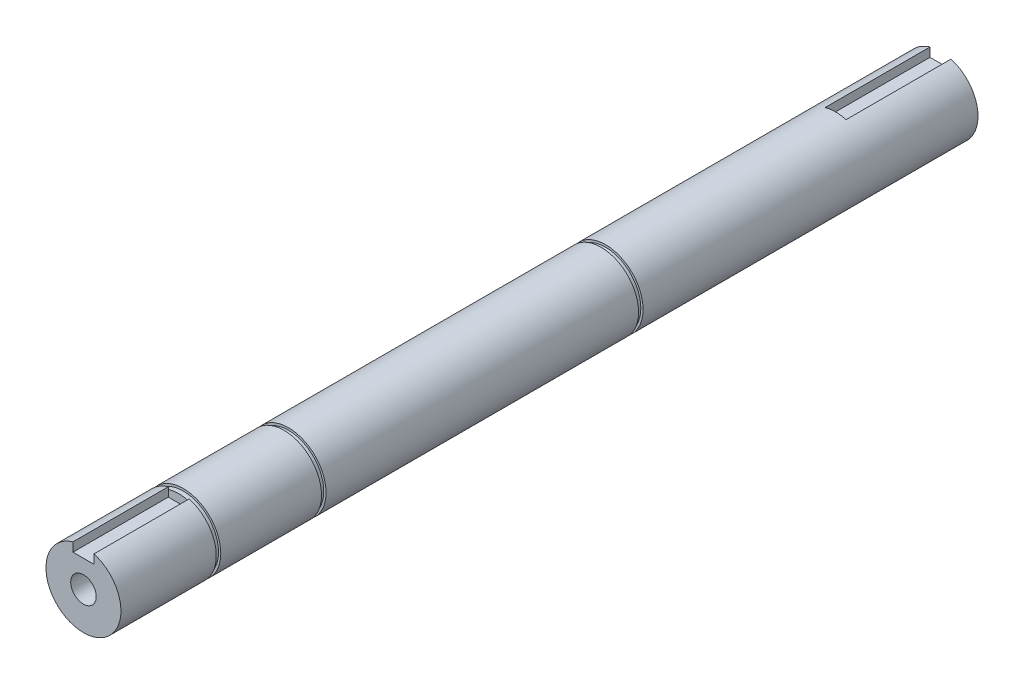
ISO-10303-21;
HEADER;
FILE_DESCRIPTION(('STEP AP214'),'2;1');
FILE_NAME('part.step','',(''),(''),'','','');
FILE_SCHEMA(('AUTOMOTIVE_DESIGN { 1 0 10303 214 1 1 1 1 }'));
ENDSEC;
DATA;
#1=APPLICATION_CONTEXT('core data for automotive mechanical design processes');
#2=APPLICATION_PROTOCOL_DEFINITION('international standard','automotive_design',2000,#1);
#3=PRODUCT_CONTEXT('',#1,'mechanical');
#4=PRODUCT('Part','Part','',(#3));
#5=PRODUCT_RELATED_PRODUCT_CATEGORY('part','',(#4));
#6=PRODUCT_DEFINITION_FORMATION('','',#4);
#7=PRODUCT_DEFINITION_CONTEXT('part definition',#1,'design');
#8=PRODUCT_DEFINITION('design','',#6,#7);
#9=PRODUCT_DEFINITION_SHAPE('','',#8);
#10=(LENGTH_UNIT() NAMED_UNIT(*) SI_UNIT(.MILLI.,.METRE.));
#11=(NAMED_UNIT(*) PLANE_ANGLE_UNIT() SI_UNIT($,.RADIAN.));
#12=(NAMED_UNIT(*) SI_UNIT($,.STERADIAN.) SOLID_ANGLE_UNIT());
#13=UNCERTAINTY_MEASURE_WITH_UNIT(LENGTH_MEASURE(1.E-05),#10,'distance_accuracy_value','');
#14=(GEOMETRIC_REPRESENTATION_CONTEXT(3) GLOBAL_UNCERTAINTY_ASSIGNED_CONTEXT((#13)) GLOBAL_UNIT_ASSIGNED_CONTEXT((#10,
#11,#12)) REPRESENTATION_CONTEXT('',''));
#15=CARTESIAN_POINT('',(0.,0.,0.));
#16=DIRECTION('',(0.,0.,1.));
#17=DIRECTION('',(1.,0.,0.));
#18=AXIS2_PLACEMENT_3D('',#15,#16,#17);
#19=CARTESIAN_POINT('',(1.15463194561016E-11,1.59594559789866E-12,-316.191648507216));
#20=DIRECTION('',(0.,0.,1.));
#21=DIRECTION('',(1.,0.,0.));
#22=AXIS2_PLACEMENT_3D('',#19,#20,#21);
#23=CYLINDRICAL_SURFACE('',#22,12.4999999999994);
#24=DIRECTION('',(0.,0.,1.));
#25=VECTOR('',#24,1.);
#26=CARTESIAN_POINT('',(3.5,12.0000000000043,-316.191648507216));
#27=LINE('',#26,#25);
#28=CARTESIAN_POINT('',(3.5,12.0000000000043,-245.83630944789));
#29=VERTEX_POINT('',#28);
#30=CARTESIAN_POINT('',(3.5,12.0000000000043,-280.83630944789));
#31=VERTEX_POINT('',#30);
#32=EDGE_CURVE('E203',#29,#31,#27,.F.);
#33=ORIENTED_EDGE('',*,*,#32,.F.);
#34=CARTESIAN_POINT('',(1.15463194561016E-11,1.59594559789866E-12,-245.83630944789));
#35=DIRECTION('',(0.,0.,-1.));
#36=DIRECTION('',(-1.,0.,0.));
#37=AXIS2_PLACEMENT_3D('',#34,#35,#36);
#38=CIRCLE('',#37,12.4999999999994);
#39=CARTESIAN_POINT('',(-3.5,11.9999999999976,-245.83630944789));
#40=VERTEX_POINT('',#39);
#41=EDGE_CURVE('E198',#29,#40,#38,.F.);
#42=ORIENTED_EDGE('',*,*,#41,.T.);
#43=DIRECTION('',(0.,0.,1.));
#44=VECTOR('',#43,1.);
#45=CARTESIAN_POINT('',(-3.5,11.9999999999976,-316.191648507216));
#46=LINE('',#45,#44);
#47=CARTESIAN_POINT('',(-3.5,11.9999999999976,-280.83630944789));
#48=VERTEX_POINT('',#47);
#49=EDGE_CURVE('E201',#48,#40,#46,.T.);
#50=ORIENTED_EDGE('',*,*,#49,.F.);
#51=CARTESIAN_POINT('',(1.15463194561016E-11,1.59594559789866E-12,-280.83630944789));
#52=DIRECTION('',(0.,0.,-1.));
#53=DIRECTION('',(0.,1.,0.));
#54=AXIS2_PLACEMENT_3D('',#51,#52,#53);
#55=CIRCLE('',#54,12.4999999999994);
#56=EDGE_CURVE('E195',#48,#31,#55,.F.);
#57=ORIENTED_EDGE('',*,*,#56,.T.);
#58=EDGE_LOOP('',(#33,#42,#50,#57));
#59=FACE_BOUND('',#58,.T.);
#60=CARTESIAN_POINT('',(1.15463194561016E-11,1.59594559789866E-12,-169.13630944789));
#61=DIRECTION('',(0.,0.,1.));
#62=DIRECTION('',(1.,0.,0.));
#63=AXIS2_PLACEMENT_3D('',#60,#61,#62);
#64=CIRCLE('',#63,12.4999999999994);
#65=CARTESIAN_POINT('',(12.5000000000109,1.59594559789866E-12,-169.13630944789));
#66=VERTEX_POINT('',#65);
#67=EDGE_CURVE('E216',#66,#66,#64,.F.);
#68=ORIENTED_EDGE('',*,*,#67,.T.);
#69=EDGE_LOOP('',(#68));
#70=FACE_BOUND('',#69,.T.);
#71=ADVANCED_FACE('F39',(#59,#70),#23,.T.);
#72=CARTESIAN_POINT('',(0.,0.,-280.83630944789));
#73=DIRECTION('',(0.,0.,-1.));
#74=DIRECTION('',(0.,1.,0.));
#75=AXIS2_PLACEMENT_3D('',#72,#73,#74);
#76=PLANE('',#75);
#77=DIRECTION('',(0.,-1.,0.));
#78=VECTOR('',#77,1.);
#79=CARTESIAN_POINT('',(3.5,16.000000000001,-280.83630944789));
#80=LINE('',#79,#78);
#81=CARTESIAN_POINT('',(3.5,9.00000000000097,-280.83630944789));
#82=VERTEX_POINT('',#81);
#83=EDGE_CURVE('E175',#31,#82,#80,.T.);
#84=ORIENTED_EDGE('',*,*,#83,.F.);
#85=ORIENTED_EDGE('',*,*,#56,.F.);
#86=DIRECTION('',(0.,1.,0.));
#87=VECTOR('',#86,1.);
#88=CARTESIAN_POINT('',(-3.5,16.000000000001,-280.83630944789));
#89=LINE('',#88,#87);
#90=CARTESIAN_POINT('',(-3.5,9.00000000000097,-280.83630944789));
#91=VERTEX_POINT('',#90);
#92=EDGE_CURVE('E171',#91,#48,#89,.T.);
#93=ORIENTED_EDGE('',*,*,#92,.F.);
#94=DIRECTION('',(-1.,0.,0.));
#95=VECTOR('',#94,1.);
#96=CARTESIAN_POINT('',(3.5,9.00000000000097,-280.83630944789));
#97=LINE('',#96,#95);
#98=EDGE_CURVE('E177',#82,#91,#97,.T.);
#99=ORIENTED_EDGE('',*,*,#98,.F.);
#100=EDGE_LOOP('',(#84,#85,#93,#99));
#101=FACE_BOUND('',#100,.T.);
#102=CARTESIAN_POINT('',(0.,0.,-280.83630944789));
#103=DIRECTION('',(0.,0.,-1.));
#104=DIRECTION('',(0.,1.,0.));
#105=AXIS2_PLACEMENT_3D('',#102,#103,#104);
#106=CIRCLE('',#105,4.24999999999999);
#107=CARTESIAN_POINT('',(0.,4.25,-280.83630944789));
#108=VERTEX_POINT('',#107);
#109=EDGE_CURVE('E184',#108,#108,#106,.T.);
#110=ORIENTED_EDGE('',*,*,#109,.F.);
#111=EDGE_LOOP('',(#110));
#112=FACE_BOUND('',#111,.T.);
#113=ADVANCED_FACE('F41',(#101,#112),#76,.T.);
#114=CARTESIAN_POINT('',(0.,0.,-253.33630944789));
#115=DIRECTION('',(0.,0.,-1.));
#116=DIRECTION('',(0.,1.,0.));
#117=AXIS2_PLACEMENT_3D('',#114,#115,#116);
#118=CONICAL_SURFACE('',#117,4.24999999999999,1.02974425867665);
#119=CARTESIAN_POINT('',(0.,0.,-250.782651817023));
#120=VERTEX_POINT('',#119);
#121=VERTEX_LOOP('',#120);
#122=FACE_BOUND('',#121,.T.);
#123=CARTESIAN_POINT('',(0.,0.,-253.33630944789));
#124=DIRECTION('',(0.,0.,-1.));
#125=DIRECTION('',(0.,1.,0.));
#126=AXIS2_PLACEMENT_3D('',#123,#124,#125);
#127=CIRCLE('',#126,4.24999999999999);
#128=CARTESIAN_POINT('',(0.,4.25,-253.33630944789));
#129=VERTEX_POINT('',#128);
#130=EDGE_CURVE('E189',#129,#129,#127,.T.);
#131=ORIENTED_EDGE('',*,*,#130,.T.);
#132=EDGE_LOOP('',(#131));
#133=FACE_BOUND('',#132,.T.);
#134=ADVANCED_FACE('F262',(#122,#133),#118,.F.);
#135=CARTESIAN_POINT('',(0.,0.,-280.83630944789));
#136=DIRECTION('',(0.,0.,-1.));
#137=DIRECTION('',(0.,1.,0.));
#138=AXIS2_PLACEMENT_3D('',#135,#136,#137);
#139=CYLINDRICAL_SURFACE('',#138,4.24999999999999);
#140=ORIENTED_EDGE('',*,*,#130,.F.);
#141=EDGE_LOOP('',(#140));
#142=FACE_BOUND('',#141,.T.);
#143=ORIENTED_EDGE('',*,*,#109,.T.);
#144=EDGE_LOOP('',(#143));
#145=FACE_BOUND('',#144,.T.);
#146=ADVANCED_FACE('F337',(#142,#145),#139,.F.);
#147=CARTESIAN_POINT('',(3.5,16.000000000001,-245.83630944789));
#148=DIRECTION('',(1.,0.,0.));
#149=DIRECTION('',(0.,0.,-1.));
#150=AXIS2_PLACEMENT_3D('',#147,#148,#149);
#151=PLANE('',#150);
#152=ORIENTED_EDGE('',*,*,#32,.T.);
#153=ORIENTED_EDGE('',*,*,#83,.T.);
#154=DIRECTION('',(0.,0.,-1.));
#155=VECTOR('',#154,1.);
#156=CARTESIAN_POINT('',(3.5,9.00000000000097,-245.83630944789));
#157=LINE('',#156,#155);
#158=CARTESIAN_POINT('',(3.5,9.00000000000097,-245.83630944789));
#159=VERTEX_POINT('',#158);
#160=EDGE_CURVE('E174',#159,#82,#157,.T.);
#161=ORIENTED_EDGE('',*,*,#160,.F.);
#162=DIRECTION('',(0.,-1.,0.));
#163=VECTOR('',#162,1.);
#164=CARTESIAN_POINT('',(3.5,16.000000000001,-245.83630944789));
#165=LINE('',#164,#163);
#166=EDGE_CURVE('E168',#29,#159,#165,.T.);
#167=ORIENTED_EDGE('',*,*,#166,.F.);
#168=EDGE_LOOP('',(#152,#153,#161,#167));
#169=FACE_BOUND('',#168,.T.);
#170=ADVANCED_FACE('F330',(#169),#151,.F.);
#171=CARTESIAN_POINT('',(-3.5,16.000000000001,-245.83630944789));
#172=DIRECTION('',(-1.,0.,0.));
#173=DIRECTION('',(0.,0.,1.));
#174=AXIS2_PLACEMENT_3D('',#171,#172,#173);
#175=PLANE('',#174);
#176=ORIENTED_EDGE('',*,*,#49,.T.);
#177=DIRECTION('',(0.,1.,0.));
#178=VECTOR('',#177,1.);
#179=CARTESIAN_POINT('',(-3.5,16.000000000001,-245.83630944789));
#180=LINE('',#179,#178);
#181=CARTESIAN_POINT('',(-3.5,9.00000000000097,-245.83630944789));
#182=VERTEX_POINT('',#181);
#183=EDGE_CURVE('E62',#182,#40,#180,.T.);
#184=ORIENTED_EDGE('',*,*,#183,.F.);
#185=DIRECTION('',(0.,0.,-1.));
#186=VECTOR('',#185,1.);
#187=CARTESIAN_POINT('',(-3.5,9.00000000000097,-245.83630944789));
#188=LINE('',#187,#186);
#189=EDGE_CURVE('E182',#182,#91,#188,.T.);
#190=ORIENTED_EDGE('',*,*,#189,.T.);
#191=ORIENTED_EDGE('',*,*,#92,.T.);
#192=EDGE_LOOP('',(#176,#184,#190,#191));
#193=FACE_BOUND('',#192,.T.);
#194=ADVANCED_FACE('F327',(#193),#175,.F.);
#195=CARTESIAN_POINT('',(3.5,9.00000000000097,-245.83630944789));
#196=DIRECTION('',(0.,-1.,0.));
#197=DIRECTION('',(0.,0.,-1.));
#198=AXIS2_PLACEMENT_3D('',#195,#196,#197);
#199=PLANE('',#198);
#200=ORIENTED_EDGE('',*,*,#98,.T.);
#201=ORIENTED_EDGE('',*,*,#189,.F.);
#202=DIRECTION('',(-1.,0.,0.));
#203=VECTOR('',#202,1.);
#204=CARTESIAN_POINT('',(3.5,9.00000000000097,-245.83630944789));
#205=LINE('',#204,#203);
#206=EDGE_CURVE('E170',#159,#182,#205,.T.);
#207=ORIENTED_EDGE('',*,*,#206,.F.);
#208=ORIENTED_EDGE('',*,*,#160,.T.);
#209=EDGE_LOOP('',(#200,#201,#207,#208));
#210=FACE_BOUND('',#209,.T.);
#211=ADVANCED_FACE('F326',(#210),#199,.F.);
#212=CARTESIAN_POINT('',(0.,0.,-245.83630944789));
#213=DIRECTION('',(0.,0.,-1.));
#214=DIRECTION('',(-1.,0.,0.));
#215=AXIS2_PLACEMENT_3D('',#212,#213,#214);
#216=PLANE('',#215);
#217=ORIENTED_EDGE('',*,*,#166,.T.);
#218=ORIENTED_EDGE('',*,*,#206,.T.);
#219=ORIENTED_EDGE('',*,*,#183,.T.);
#220=ORIENTED_EDGE('',*,*,#41,.F.);
#221=EDGE_LOOP('',(#217,#218,#219,#220));
#222=FACE_BOUND('',#221,.T.);
#223=ADVANCED_FACE('F318',(#222),#216,.T.);
#224=CARTESIAN_POINT('',(0.,14.500000000001,-167.63630944789));
#225=DIRECTION('',(0.,0.,-1.));
#226=DIRECTION('',(-1.,0.,0.));
#227=AXIS2_PLACEMENT_3D('',#224,#225,#226);
#228=PLANE('',#227);
#229=CARTESIAN_POINT('',(1.15463194561016E-11,1.59594559789866E-12,-167.63630944789));
#230=DIRECTION('',(0.,0.,-1.));
#231=DIRECTION('',(-1.,0.,0.));
#232=AXIS2_PLACEMENT_3D('',#229,#230,#231);
#233=CIRCLE('',#232,12.4999999999994);
#234=CARTESIAN_POINT('',(-12.4999999999878,1.59594559789866E-12,-167.63630944789));
#235=VERTEX_POINT('',#234);
#236=EDGE_CURVE('E178',#235,#235,#233,.F.);
#237=ORIENTED_EDGE('',*,*,#236,.F.);
#238=EDGE_LOOP('',(#237));
#239=FACE_BOUND('',#238,.T.);
#240=CARTESIAN_POINT('',(0.,0.,-167.63630944789));
#241=DIRECTION('',(0.,0.,1.));
#242=DIRECTION('',(1.,0.,0.));
#243=AXIS2_PLACEMENT_3D('',#240,#241,#242);
#244=CIRCLE('',#243,11.7500000000015);
#245=CARTESIAN_POINT('',(11.7500000000015,0.,-167.63630944789));
#246=VERTEX_POINT('',#245);
#247=EDGE_CURVE('E159',#246,#246,#244,.T.);
#248=ORIENTED_EDGE('',*,*,#247,.T.);
#249=EDGE_LOOP('',(#248));
#250=FACE_BOUND('',#249,.T.);
#251=ADVANCED_FACE('F315',(#239,#250),#228,.T.);
#252=CARTESIAN_POINT('',(0.,0.,1000.));
#253=DIRECTION('',(0.,0.,1.));
#254=DIRECTION('',(1.,0.,0.));
#255=AXIS2_PLACEMENT_3D('',#252,#253,#254);
#256=CYLINDRICAL_SURFACE('',#255,11.7500000000015);
#257=CARTESIAN_POINT('',(0.,0.,-169.13630944789));
#258=DIRECTION('',(0.,0.,1.));
#259=DIRECTION('',(1.,0.,0.));
#260=AXIS2_PLACEMENT_3D('',#257,#258,#259);
#261=CIRCLE('',#260,11.7500000000015);
#262=CARTESIAN_POINT('',(11.7500000000015,0.,-169.13630944789));
#263=VERTEX_POINT('',#262);
#264=EDGE_CURVE('E149',#263,#263,#261,.T.);
#265=ORIENTED_EDGE('',*,*,#264,.T.);
#266=EDGE_LOOP('',(#265));
#267=FACE_BOUND('',#266,.T.);
#268=ORIENTED_EDGE('',*,*,#247,.F.);
#269=EDGE_LOOP('',(#268));
#270=FACE_BOUND('',#269,.T.);
#271=ADVANCED_FACE('F280',(#267,#270),#256,.T.);
#272=CARTESIAN_POINT('',(0.,14.500000000001,-169.13630944789));
#273=DIRECTION('',(0.,0.,1.));
#274=DIRECTION('',(1.,0.,0.));
#275=AXIS2_PLACEMENT_3D('',#272,#273,#274);
#276=PLANE('',#275);
#277=ORIENTED_EDGE('',*,*,#67,.F.);
#278=EDGE_LOOP('',(#277));
#279=FACE_BOUND('',#278,.T.);
#280=ORIENTED_EDGE('',*,*,#264,.F.);
#281=EDGE_LOOP('',(#280));
#282=FACE_BOUND('',#281,.T.);
#283=ADVANCED_FACE('F271',(#279,#282),#276,.T.);
#284=CARTESIAN_POINT('',(1.15463194561016E-11,1.59594559789866E-12,-63.4000000000001));
#285=DIRECTION('',(0.,0.,1.));
#286=DIRECTION('',(1.,0.,0.));
#287=AXIS2_PLACEMENT_3D('',#284,#285,#286);
#288=CIRCLE('',#287,12.4999999999994);
#289=CARTESIAN_POINT('',(12.5000000000109,1.59594559789866E-12,-63.4000000000001));
#290=VERTEX_POINT('',#289);
#291=EDGE_CURVE('E207',#290,#290,#288,.F.);
#292=ORIENTED_EDGE('',*,*,#291,.T.);
#293=EDGE_LOOP('',(#292));
#294=FACE_BOUND('',#293,.T.);
#295=ORIENTED_EDGE('',*,*,#236,.T.);
#296=EDGE_LOOP('',(#295));
#297=FACE_BOUND('',#296,.T.);
#298=ADVANCED_FACE('F258',(#294,#297),#23,.T.);
#299=CARTESIAN_POINT('',(0.,11.7500000000015,-63.4000000000001));
#300=DIRECTION('',(0.,0.,1.));
#301=DIRECTION('',(1.,0.,0.));
#302=AXIS2_PLACEMENT_3D('',#299,#300,#301);
#303=PLANE('',#302);
#304=ORIENTED_EDGE('',*,*,#291,.F.);
#305=EDGE_LOOP('',(#304));
#306=FACE_BOUND('',#305,.T.);
#307=CARTESIAN_POINT('',(0.,0.,-63.4000000000001));
#308=DIRECTION('',(0.,0.,1.));
#309=DIRECTION('',(1.,0.,0.));
#310=AXIS2_PLACEMENT_3D('',#307,#308,#309);
#311=CIRCLE('',#310,11.7500000000015);
#312=CARTESIAN_POINT('',(11.7500000000015,0.,-63.4000000000001));
#313=VERTEX_POINT('',#312);
#314=EDGE_CURVE('E156',#313,#313,#311,.T.);
#315=ORIENTED_EDGE('',*,*,#314,.F.);
#316=EDGE_LOOP('',(#315));
#317=FACE_BOUND('',#316,.T.);
#318=ADVANCED_FACE('F270',(#306,#317),#303,.T.);
#319=CARTESIAN_POINT('',(0.,11.7500000000015,-61.9000000000001));
#320=DIRECTION('',(0.,0.,-1.));
#321=DIRECTION('',(-1.,0.,0.));
#322=AXIS2_PLACEMENT_3D('',#319,#320,#321);
#323=PLANE('',#322);
#324=CARTESIAN_POINT('',(1.15463194561016E-11,1.59594559789866E-12,-61.9000000000001));
#325=DIRECTION('',(0.,0.,-1.));
#326=DIRECTION('',(-1.,0.,0.));
#327=AXIS2_PLACEMENT_3D('',#324,#325,#326);
#328=CIRCLE('',#327,12.4999999999994);
#329=CARTESIAN_POINT('',(-12.4999999999878,1.59594559789866E-12,-61.9000000000001));
#330=VERTEX_POINT('',#329);
#331=EDGE_CURVE('E167',#330,#330,#328,.F.);
#332=ORIENTED_EDGE('',*,*,#331,.F.);
#333=EDGE_LOOP('',(#332));
#334=FACE_BOUND('',#333,.T.);
#335=CARTESIAN_POINT('',(0.,0.,-61.9000000000001));
#336=DIRECTION('',(0.,0.,1.));
#337=DIRECTION('',(1.,0.,0.));
#338=AXIS2_PLACEMENT_3D('',#335,#336,#337);
#339=CIRCLE('',#338,11.7500000000015);
#340=CARTESIAN_POINT('',(11.7500000000015,0.,-61.9000000000001));
#341=VERTEX_POINT('',#340);
#342=EDGE_CURVE('E164',#341,#341,#339,.T.);
#343=ORIENTED_EDGE('',*,*,#342,.T.);
#344=EDGE_LOOP('',(#343));
#345=FACE_BOUND('',#344,.T.);
#346=ADVANCED_FACE('F277',(#334,#345),#323,.T.);
#347=CARTESIAN_POINT('',(0.,0.,1000.));
#348=DIRECTION('',(0.,0.,1.));
#349=DIRECTION('',(1.,0.,0.));
#350=AXIS2_PLACEMENT_3D('',#347,#348,#349);
#351=CYLINDRICAL_SURFACE('',#350,11.7500000000015);
#352=ORIENTED_EDGE('',*,*,#314,.T.);
#353=EDGE_LOOP('',(#352));
#354=FACE_BOUND('',#353,.T.);
#355=ORIENTED_EDGE('',*,*,#342,.F.);
#356=EDGE_LOOP('',(#355));
#357=FACE_BOUND('',#356,.T.);
#358=ADVANCED_FACE('F285',(#354,#357),#351,.T.);
#359=ORIENTED_EDGE('',*,*,#331,.T.);
#360=EDGE_LOOP('',(#359));
#361=FACE_BOUND('',#360,.T.);
#362=CARTESIAN_POINT('',(1.15463194561016E-11,1.59594559789866E-12,-28.3));
#363=DIRECTION('',(0.,0.,1.));
#364=DIRECTION('',(1.,0.,0.));
#365=AXIS2_PLACEMENT_3D('',#362,#363,#364);
#366=CIRCLE('',#365,12.4999999999994);
#367=CARTESIAN_POINT('',(12.5000000000109,1.59594559789866E-12,-28.3));
#368=VERTEX_POINT('',#367);
#369=EDGE_CURVE('E210',#368,#368,#366,.F.);
#370=ORIENTED_EDGE('',*,*,#369,.T.);
#371=EDGE_LOOP('',(#370));
#372=FACE_BOUND('',#371,.T.);
#373=ADVANCED_FACE('F268',(#361,#372),#23,.T.);
#374=CARTESIAN_POINT('',(0.,11.7500000000015,-26.8000000000001));
#375=DIRECTION('',(0.,0.,-1.));
#376=DIRECTION('',(-1.,0.,0.));
#377=AXIS2_PLACEMENT_3D('',#374,#375,#376);
#378=PLANE('',#377);
#379=DIRECTION('',(0.,1.,0.));
#380=VECTOR('',#379,1.);
#381=CARTESIAN_POINT('',(-3.5,1.59802181418804E-12,-26.8));
#382=LINE('',#381,#380);
#383=CARTESIAN_POINT('',(-3.5,11.2166171370888,-26.8000000000002));
#384=VERTEX_POINT('',#383);
#385=CARTESIAN_POINT('',(-3.5,11.9999999999976,-26.8));
#386=VERTEX_POINT('',#385);
#387=EDGE_CURVE('E139',#384,#386,#382,.T.);
#388=ORIENTED_EDGE('',*,*,#387,.F.);
#389=CARTESIAN_POINT('',(0.,0.,-26.8000000000002));
#390=DIRECTION('',(0.,0.,1.));
#391=DIRECTION('',(1.,0.,0.));
#392=AXIS2_PLACEMENT_3D('',#389,#390,#391);
#393=CIRCLE('',#392,11.7500000000015);
#394=CARTESIAN_POINT('',(3.5,11.2166171370888,-26.8000000000002));
#395=VERTEX_POINT('',#394);
#396=EDGE_CURVE('E153',#384,#395,#393,.T.);
#397=ORIENTED_EDGE('',*,*,#396,.T.);
#398=DIRECTION('',(0.,-1.,0.));
#399=VECTOR('',#398,1.);
#400=CARTESIAN_POINT('',(3.5,1.59802181418804E-12,-26.8));
#401=LINE('',#400,#399);
#402=CARTESIAN_POINT('',(3.5,12.0000000000043,-26.8));
#403=VERTEX_POINT('',#402);
#404=EDGE_CURVE('E134',#403,#395,#401,.T.);
#405=ORIENTED_EDGE('',*,*,#404,.F.);
#406=CARTESIAN_POINT('',(1.15463194561016E-11,1.59594559789866E-12,-26.8));
#407=DIRECTION('',(0.,0.,-1.));
#408=DIRECTION('',(-1.,0.,0.));
#409=AXIS2_PLACEMENT_3D('',#406,#407,#408);
#410=CIRCLE('',#409,12.4999999999994);
#411=EDGE_CURVE('E213',#386,#403,#410,.F.);
#412=ORIENTED_EDGE('',*,*,#411,.F.);
#413=EDGE_LOOP('',(#388,#397,#405,#412));
#414=FACE_BOUND('',#413,.T.);
#415=ADVANCED_FACE('F229',(#414),#378,.T.);
#416=CARTESIAN_POINT('',(0.,11.7500000000015,-28.3000000000001));
#417=DIRECTION('',(0.,0.,1.));
#418=DIRECTION('',(1.,0.,0.));
#419=AXIS2_PLACEMENT_3D('',#416,#417,#418);
#420=PLANE('',#419);
#421=ORIENTED_EDGE('',*,*,#369,.F.);
#422=EDGE_LOOP('',(#421));
#423=FACE_BOUND('',#422,.T.);
#424=CARTESIAN_POINT('',(0.,0.,-28.3));
#425=DIRECTION('',(0.,0.,1.));
#426=DIRECTION('',(1.,0.,0.));
#427=AXIS2_PLACEMENT_3D('',#424,#425,#426);
#428=CIRCLE('',#427,11.7500000000015);
#429=CARTESIAN_POINT('',(11.7500000000015,0.,-28.3));
#430=VERTEX_POINT('',#429);
#431=EDGE_CURVE('E152',#430,#430,#428,.T.);
#432=ORIENTED_EDGE('',*,*,#431,.F.);
#433=EDGE_LOOP('',(#432));
#434=FACE_BOUND('',#433,.T.);
#435=ADVANCED_FACE('F292',(#423,#434),#420,.T.);
#436=CARTESIAN_POINT('',(0.,0.,1000.));
#437=DIRECTION('',(0.,0.,1.));
#438=DIRECTION('',(1.,0.,0.));
#439=AXIS2_PLACEMENT_3D('',#436,#437,#438);
#440=CYLINDRICAL_SURFACE('',#439,11.7500000000015);
#441=ORIENTED_EDGE('',*,*,#431,.T.);
#442=EDGE_LOOP('',(#441));
#443=FACE_BOUND('',#442,.T.);
#444=EDGE_CURVE('E150',#395,#384,#393,.T.);
#445=ORIENTED_EDGE('',*,*,#444,.F.);
#446=ORIENTED_EDGE('',*,*,#396,.F.);
#447=EDGE_LOOP('',(#445,#446));
#448=FACE_BOUND('',#447,.T.);
#449=ADVANCED_FACE('F248',(#443,#448),#440,.T.);
#450=CARTESIAN_POINT('',(1.15463194561016E-11,1.59594559789866E-12,5.));
#451=DIRECTION('',(0.,0.,1.));
#452=DIRECTION('',(1.,0.,0.));
#453=AXIS2_PLACEMENT_3D('',#450,#451,#452);
#454=PLANE('',#453);
#455=CARTESIAN_POINT('',(0.,0.,5.));
#456=DIRECTION('',(0.,0.,1.));
#457=DIRECTION('',(1.,0.,0.));
#458=AXIS2_PLACEMENT_3D('',#455,#456,#457);
#459=CIRCLE('',#458,4.24999999999999);
#460=CARTESIAN_POINT('',(4.24999999999999,0.,5.));
#461=VERTEX_POINT('',#460);
#462=EDGE_CURVE('E125',#461,#461,#459,.T.);
#463=ORIENTED_EDGE('',*,*,#462,.F.);
#464=EDGE_LOOP('',(#463));
#465=FACE_BOUND('',#464,.T.);
#466=DIRECTION('',(0.,-1.,0.));
#467=VECTOR('',#466,1.);
#468=CARTESIAN_POINT('',(-3.5,1.59594559789866E-12,5.));
#469=LINE('',#468,#467);
#470=CARTESIAN_POINT('',(-3.5,11.9999999999976,5.));
#471=VERTEX_POINT('',#470);
#472=CARTESIAN_POINT('',(-3.5,9.00000000000096,5.));
#473=VERTEX_POINT('',#472);
#474=EDGE_CURVE('E124',#471,#473,#469,.T.);
#475=ORIENTED_EDGE('',*,*,#474,.F.);
#476=CARTESIAN_POINT('',(1.15463194561016E-11,1.59594559789866E-12,5.));
#477=DIRECTION('',(0.,0.,1.));
#478=DIRECTION('',(1.,0.,0.));
#479=AXIS2_PLACEMENT_3D('',#476,#477,#478);
#480=CIRCLE('',#479,12.4999999999994);
#481=CARTESIAN_POINT('',(3.5,12.0000000000043,5.));
#482=VERTEX_POINT('',#481);
#483=EDGE_CURVE('E192',#471,#482,#480,.T.);
#484=ORIENTED_EDGE('',*,*,#483,.T.);
#485=DIRECTION('',(0.,1.,0.));
#486=VECTOR('',#485,1.);
#487=CARTESIAN_POINT('',(3.5,1.59594559789866E-12,5.));
#488=LINE('',#487,#486);
#489=CARTESIAN_POINT('',(3.5,9.00000000000096,5.));
#490=VERTEX_POINT('',#489);
#491=EDGE_CURVE('E54',#490,#482,#488,.T.);
#492=ORIENTED_EDGE('',*,*,#491,.F.);
#493=DIRECTION('',(1.,0.,0.));
#494=VECTOR('',#493,1.);
#495=CARTESIAN_POINT('',(1.15463194561016E-11,9.00000000000096,5.));
#496=LINE('',#495,#494);
#497=EDGE_CURVE('E127',#473,#490,#496,.T.);
#498=ORIENTED_EDGE('',*,*,#497,.F.);
#499=EDGE_LOOP('',(#475,#484,#492,#498));
#500=FACE_BOUND('',#499,.T.);
#501=ADVANCED_FACE('F240',(#465,#500),#454,.T.);
#502=DIRECTION('',(0.,0.,1.));
#503=VECTOR('',#502,1.);
#504=CARTESIAN_POINT('',(-3.5,11.9999999999976,-316.191648507216));
#505=LINE('',#504,#503);
#506=EDGE_CURVE('E11',#386,#471,#505,.T.);
#507=ORIENTED_EDGE('',*,*,#506,.F.);
#508=ORIENTED_EDGE('',*,*,#411,.T.);
#509=DIRECTION('',(0.,0.,1.));
#510=VECTOR('',#509,1.);
#511=CARTESIAN_POINT('',(3.5,12.0000000000043,-316.191648507216));
#512=LINE('',#511,#510);
#513=EDGE_CURVE('E47',#482,#403,#512,.F.);
#514=ORIENTED_EDGE('',*,*,#513,.F.);
#515=ORIENTED_EDGE('',*,*,#483,.F.);
#516=EDGE_LOOP('',(#507,#508,#514,#515));
#517=FACE_BOUND('',#516,.T.);
#518=ADVANCED_FACE('F233',(#517),#23,.T.);
#519=CARTESIAN_POINT('',(-3.5,1.59802181418804E-12,-36.6994949366117));
#520=DIRECTION('',(-1.,0.,0.));
#521=DIRECTION('',(0.,0.,1.));
#522=AXIS2_PLACEMENT_3D('',#519,#520,#521);
#523=PLANE('',#522);
#524=ORIENTED_EDGE('',*,*,#506,.T.);
#525=ORIENTED_EDGE('',*,*,#474,.T.);
#526=DIRECTION('',(0.,0.,1.));
#527=VECTOR('',#526,1.);
#528=CARTESIAN_POINT('',(-3.5,9.00000000000096,-36.6994949366117));
#529=LINE('',#528,#527);
#530=CARTESIAN_POINT('',(-3.5,9.00000000000096,-26.8));
#531=VERTEX_POINT('',#530);
#532=EDGE_CURVE('E144',#531,#473,#529,.T.);
#533=ORIENTED_EDGE('',*,*,#532,.F.);
#534=EDGE_CURVE('E136',#531,#384,#382,.T.);
#535=ORIENTED_EDGE('',*,*,#534,.T.);
#536=ORIENTED_EDGE('',*,*,#387,.T.);
#537=EDGE_LOOP('',(#524,#525,#533,#535,#536));
#538=FACE_BOUND('',#537,.T.);
#539=ADVANCED_FACE('F236',(#538),#523,.F.);
#540=CARTESIAN_POINT('',(3.5,1.59802181418804E-12,-36.6994949366117));
#541=DIRECTION('',(1.,0.,0.));
#542=DIRECTION('',(0.,0.,-1.));
#543=AXIS2_PLACEMENT_3D('',#540,#541,#542);
#544=PLANE('',#543);
#545=ORIENTED_EDGE('',*,*,#513,.T.);
#546=ORIENTED_EDGE('',*,*,#404,.T.);
#547=CARTESIAN_POINT('',(3.5,9.00000000000096,-26.8));
#548=VERTEX_POINT('',#547);
#549=EDGE_CURVE('E132',#395,#548,#401,.T.);
#550=ORIENTED_EDGE('',*,*,#549,.T.);
#551=DIRECTION('',(0.,0.,1.));
#552=VECTOR('',#551,1.);
#553=CARTESIAN_POINT('',(3.5,9.00000000000096,-36.6994949366117));
#554=LINE('',#553,#552);
#555=EDGE_CURVE('E135',#548,#490,#554,.T.);
#556=ORIENTED_EDGE('',*,*,#555,.T.);
#557=ORIENTED_EDGE('',*,*,#491,.T.);
#558=EDGE_LOOP('',(#545,#546,#550,#556,#557));
#559=FACE_BOUND('',#558,.T.);
#560=ADVANCED_FACE('F222',(#559),#544,.F.);
#561=CARTESIAN_POINT('',(1.15463194561016E-11,9.00000000000096,-36.6994949366117));
#562=DIRECTION('',(0.,-1.,0.));
#563=DIRECTION('',(0.,0.,-1.));
#564=AXIS2_PLACEMENT_3D('',#561,#562,#563);
#565=PLANE('',#564);
#566=DIRECTION('',(-1.,0.,0.));
#567=VECTOR('',#566,1.);
#568=CARTESIAN_POINT('',(1.15463194561016E-11,9.00000000000096,-26.8));
#569=LINE('',#568,#567);
#570=EDGE_CURVE('E138',#548,#531,#569,.T.);
#571=ORIENTED_EDGE('',*,*,#570,.T.);
#572=ORIENTED_EDGE('',*,*,#532,.T.);
#573=ORIENTED_EDGE('',*,*,#497,.T.);
#574=ORIENTED_EDGE('',*,*,#555,.F.);
#575=EDGE_LOOP('',(#571,#572,#573,#574));
#576=FACE_BOUND('',#575,.T.);
#577=ADVANCED_FACE('F243',(#576),#565,.F.);
#578=CARTESIAN_POINT('',(0.,12.500000000001,-26.8));
#579=DIRECTION('',(0.,0.,1.));
#580=DIRECTION('',(1.,0.,0.));
#581=AXIS2_PLACEMENT_3D('',#578,#579,#580);
#582=PLANE('',#581);
#583=ORIENTED_EDGE('',*,*,#534,.F.);
#584=ORIENTED_EDGE('',*,*,#570,.F.);
#585=ORIENTED_EDGE('',*,*,#549,.F.);
#586=ORIENTED_EDGE('',*,*,#444,.T.);
#587=EDGE_LOOP('',(#583,#584,#585,#586));
#588=FACE_BOUND('',#587,.T.);
#589=ADVANCED_FACE('F118',(#588),#582,.T.);
#590=CARTESIAN_POINT('',(0.,0.,-22.5));
#591=DIRECTION('',(0.,0.,1.));
#592=DIRECTION('',(1.,0.,0.));
#593=AXIS2_PLACEMENT_3D('',#590,#591,#592);
#594=CONICAL_SURFACE('',#593,4.24999999999999,1.02974425867665);
#595=CARTESIAN_POINT('',(0.,0.,-25.0536576308671));
#596=VERTEX_POINT('',#595);
#597=VERTEX_LOOP('',#596);
#598=FACE_BOUND('',#597,.T.);
#599=CARTESIAN_POINT('',(0.,0.,-22.5));
#600=DIRECTION('',(0.,0.,1.));
#601=DIRECTION('',(1.,0.,0.));
#602=AXIS2_PLACEMENT_3D('',#599,#600,#601);
#603=CIRCLE('',#602,4.24999999999999);
#604=CARTESIAN_POINT('',(4.24999999999999,0.,-22.5));
#605=VERTEX_POINT('',#604);
#606=EDGE_CURVE('E122',#605,#605,#603,.T.);
#607=ORIENTED_EDGE('',*,*,#606,.T.);
#608=EDGE_LOOP('',(#607));
#609=FACE_BOUND('',#608,.T.);
#610=ADVANCED_FACE('F114',(#598,#609),#594,.F.);
#611=CARTESIAN_POINT('',(0.,0.,5.));
#612=DIRECTION('',(0.,0.,1.));
#613=DIRECTION('',(1.,0.,0.));
#614=AXIS2_PLACEMENT_3D('',#611,#612,#613);
#615=CYLINDRICAL_SURFACE('',#614,4.24999999999999);
#616=ORIENTED_EDGE('',*,*,#606,.F.);
#617=EDGE_LOOP('',(#616));
#618=FACE_BOUND('',#617,.T.);
#619=ORIENTED_EDGE('',*,*,#462,.T.);
#620=EDGE_LOOP('',(#619));
#621=FACE_BOUND('',#620,.T.);
#622=ADVANCED_FACE('F117',(#618,#621),#615,.F.);
#623=CLOSED_SHELL('',(#71,#113,#134,#146,#170,#194,#211,#223,#251,#271,#283,#298,#318,#346,#358,
#373,#415,#435,#449,#501,#518,#539,#560,#577,#589,#610,#622));
#624=MANIFOLD_SOLID_BREP('B2',#623);
#625=ADVANCED_BREP_SHAPE_REPRESENTATION('',(#18,#624),#14);
#626=SHAPE_DEFINITION_REPRESENTATION(#9,#625);
ENDSEC;
END-ISO-10303-21;
